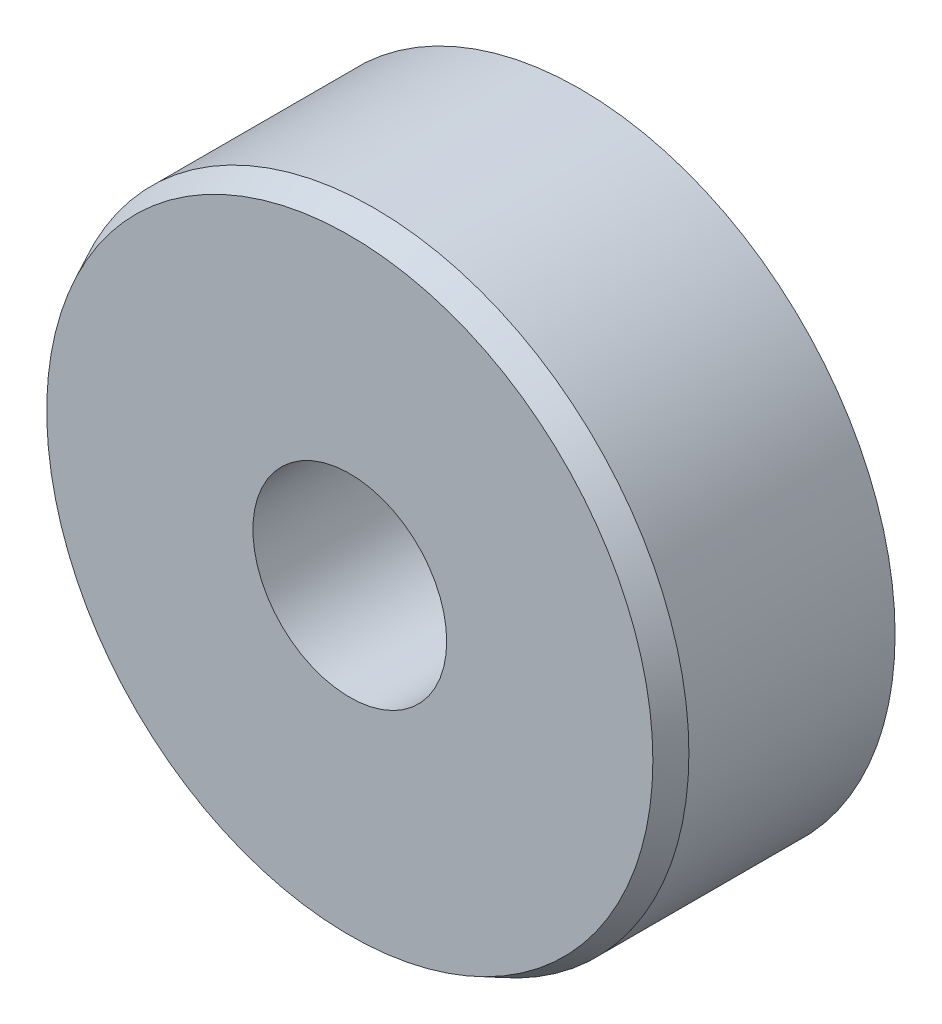
ISO-10303-21;
HEADER;
FILE_DESCRIPTION(('STEP AP214'),'2;1');
FILE_NAME('part.step','',(''),(''),'','','');
FILE_SCHEMA(('AUTOMOTIVE_DESIGN { 1 0 10303 214 1 1 1 1 }'));
ENDSEC;
DATA;
#1=APPLICATION_CONTEXT('core data for automotive mechanical design processes');
#2=APPLICATION_PROTOCOL_DEFINITION('international standard','automotive_design',2000,#1);
#3=PRODUCT_CONTEXT('',#1,'mechanical');
#4=PRODUCT('Part','Part','',(#3));
#5=PRODUCT_RELATED_PRODUCT_CATEGORY('part','',(#4));
#6=PRODUCT_DEFINITION_FORMATION('','',#4);
#7=PRODUCT_DEFINITION_CONTEXT('part definition',#1,'design');
#8=PRODUCT_DEFINITION('design','',#6,#7);
#9=PRODUCT_DEFINITION_SHAPE('','',#8);
#10=(LENGTH_UNIT() NAMED_UNIT(*) SI_UNIT(.MILLI.,.METRE.));
#11=(NAMED_UNIT(*) PLANE_ANGLE_UNIT() SI_UNIT($,.RADIAN.));
#12=(NAMED_UNIT(*) SI_UNIT($,.STERADIAN.) SOLID_ANGLE_UNIT());
#13=UNCERTAINTY_MEASURE_WITH_UNIT(LENGTH_MEASURE(1.E-05),#10,'distance_accuracy_value','');
#14=(GEOMETRIC_REPRESENTATION_CONTEXT(3) GLOBAL_UNCERTAINTY_ASSIGNED_CONTEXT((#13)) GLOBAL_UNIT_ASSIGNED_CONTEXT((#10,
#11,#12)) REPRESENTATION_CONTEXT('',''));
#15=CARTESIAN_POINT('',(0.,0.,0.));
#16=DIRECTION('',(0.,0.,1.));
#17=DIRECTION('',(1.,0.,0.));
#18=AXIS2_PLACEMENT_3D('',#15,#16,#17);
#19=CARTESIAN_POINT('',(0.,0.,5.));
#20=DIRECTION('',(0.,0.,1.));
#21=DIRECTION('',(1.,0.,0.));
#22=AXIS2_PLACEMENT_3D('',#19,#20,#21);
#23=PLANE('',#22);
#24=CARTESIAN_POINT('',(0.,0.,5.));
#25=DIRECTION('',(0.,0.,1.));
#26=DIRECTION('',(1.,0.,0.));
#27=AXIS2_PLACEMENT_3D('',#24,#25,#26);
#28=CIRCLE('',#27,6.25613370571707);
#29=CARTESIAN_POINT('',(6.25613370571707,0.,5.));
#30=VERTEX_POINT('',#29);
#31=EDGE_CURVE('E10',#30,#30,#28,.T.);
#32=ORIENTED_EDGE('',*,*,#31,.T.);
#33=EDGE_LOOP('',(#32));
#34=FACE_BOUND('',#33,.T.);
#35=CARTESIAN_POINT('',(0.,0.,5.));
#36=DIRECTION('',(0.,0.,1.));
#37=DIRECTION('',(1.,0.,0.));
#38=AXIS2_PLACEMENT_3D('',#35,#36,#37);
#39=CIRCLE('',#38,2.);
#40=CARTESIAN_POINT('',(2.,0.,5.));
#41=VERTEX_POINT('',#40);
#42=EDGE_CURVE('E50',#41,#41,#39,.T.);
#43=ORIENTED_EDGE('',*,*,#42,.F.);
#44=EDGE_LOOP('',(#43));
#45=FACE_BOUND('',#44,.T.);
#46=ADVANCED_FACE('F30',(#34,#45),#23,.T.);
#47=CARTESIAN_POINT('',(0.,0.,0.));
#48=DIRECTION('',(0.,0.,1.));
#49=DIRECTION('',(1.,0.,0.));
#50=AXIS2_PLACEMENT_3D('',#47,#48,#49);
#51=PLANE('',#50);
#52=CARTESIAN_POINT('',(0.,0.,0.));
#53=DIRECTION('',(0.,0.,1.));
#54=DIRECTION('',(1.,0.,0.));
#55=AXIS2_PLACEMENT_3D('',#52,#53,#54);
#56=CIRCLE('',#55,5.99999999999999);
#57=CARTESIAN_POINT('',(5.99999999999999,0.,0.));
#58=VERTEX_POINT('',#57);
#59=EDGE_CURVE('E37',#58,#58,#56,.F.);
#60=ORIENTED_EDGE('',*,*,#59,.T.);
#61=EDGE_LOOP('',(#60));
#62=FACE_BOUND('',#61,.T.);
#63=CARTESIAN_POINT('',(0.,0.,0.));
#64=DIRECTION('',(0.,0.,1.));
#65=DIRECTION('',(1.,0.,0.));
#66=AXIS2_PLACEMENT_3D('',#63,#64,#65);
#67=CIRCLE('',#66,2.);
#68=CARTESIAN_POINT('',(2.,0.,0.));
#69=VERTEX_POINT('',#68);
#70=EDGE_CURVE('E51',#69,#69,#67,.T.);
#71=ORIENTED_EDGE('',*,*,#70,.T.);
#72=EDGE_LOOP('',(#71));
#73=FACE_BOUND('',#72,.T.);
#74=ADVANCED_FACE('F61',(#62,#73),#51,.F.);
#75=CARTESIAN_POINT('',(0.,0.,5.));
#76=DIRECTION('',(0.,0.,-1.));
#77=DIRECTION('',(-1.,0.,0.));
#78=AXIS2_PLACEMENT_3D('',#75,#76,#77);
#79=CYLINDRICAL_SURFACE('',#78,6.5);
#80=CARTESIAN_POINT('',(0.,0.,0.243866294282933));
#81=DIRECTION('',(0.,0.,1.));
#82=DIRECTION('',(1.,0.,0.));
#83=AXIS2_PLACEMENT_3D('',#80,#81,#82);
#84=CIRCLE('',#83,6.5);
#85=CARTESIAN_POINT('',(6.5,0.,0.243866294282933));
#86=VERTEX_POINT('',#85);
#87=EDGE_CURVE('E41',#86,#86,#84,.T.);
#88=ORIENTED_EDGE('',*,*,#87,.T.);
#89=EDGE_LOOP('',(#88));
#90=FACE_BOUND('',#89,.T.);
#91=CARTESIAN_POINT('',(0.,0.,4.5));
#92=DIRECTION('',(0.,0.,1.));
#93=DIRECTION('',(1.,0.,0.));
#94=AXIS2_PLACEMENT_3D('',#91,#92,#93);
#95=CIRCLE('',#94,6.5);
#96=CARTESIAN_POINT('',(6.5,0.,4.5));
#97=VERTEX_POINT('',#96);
#98=EDGE_CURVE('E45',#97,#97,#95,.F.);
#99=ORIENTED_EDGE('',*,*,#98,.T.);
#100=EDGE_LOOP('',(#99));
#101=FACE_BOUND('',#100,.T.);
#102=ADVANCED_FACE('F66',(#90,#101),#79,.T.);
#103=CARTESIAN_POINT('',(0.,0.,5.));
#104=DIRECTION('',(0.,0.,-1.));
#105=DIRECTION('',(-1.,0.,0.));
#106=AXIS2_PLACEMENT_3D('',#103,#104,#105);
#107=CYLINDRICAL_SURFACE('',#106,2.);
#108=ORIENTED_EDGE('',*,*,#42,.T.);
#109=EDGE_LOOP('',(#108));
#110=FACE_BOUND('',#109,.T.);
#111=ORIENTED_EDGE('',*,*,#70,.F.);
#112=EDGE_LOOP('',(#111));
#113=FACE_BOUND('',#112,.T.);
#114=ADVANCED_FACE('F57',(#110,#113),#107,.F.);
#115=CARTESIAN_POINT('',(0.,0.,0.243866294282933));
#116=DIRECTION('',(0.,0.,1.));
#117=DIRECTION('',(1.,0.,0.));
#118=AXIS2_PLACEMENT_3D('',#115,#116,#117);
#119=CONICAL_SURFACE('',#118,6.5,1.11701072127637);
#120=ORIENTED_EDGE('',*,*,#59,.F.);
#121=EDGE_LOOP('',(#120));
#122=FACE_BOUND('',#121,.T.);
#123=ORIENTED_EDGE('',*,*,#87,.F.);
#124=EDGE_LOOP('',(#123));
#125=FACE_BOUND('',#124,.T.);
#126=ADVANCED_FACE('F72',(#122,#125),#119,.T.);
#127=CARTESIAN_POINT('',(0.,0.,5.));
#128=DIRECTION('',(0.,0.,-1.));
#129=DIRECTION('',(-1.,0.,0.));
#130=AXIS2_PLACEMENT_3D('',#127,#128,#129);
#131=CONICAL_SURFACE('',#130,6.25613370571707,0.453785605518522);
#132=ORIENTED_EDGE('',*,*,#98,.F.);
#133=EDGE_LOOP('',(#132));
#134=FACE_BOUND('',#133,.T.);
#135=ORIENTED_EDGE('',*,*,#31,.F.);
#136=EDGE_LOOP('',(#135));
#137=FACE_BOUND('',#136,.T.);
#138=ADVANCED_FACE('F32',(#134,#137),#131,.T.);
#139=CLOSED_SHELL('',(#46,#74,#102,#114,#126,#138));
#140=MANIFOLD_SOLID_BREP('B2',#139);
#141=ADVANCED_BREP_SHAPE_REPRESENTATION('',(#18,#140),#14);
#142=SHAPE_DEFINITION_REPRESENTATION(#9,#141);
ENDSEC;
END-ISO-10303-21;
